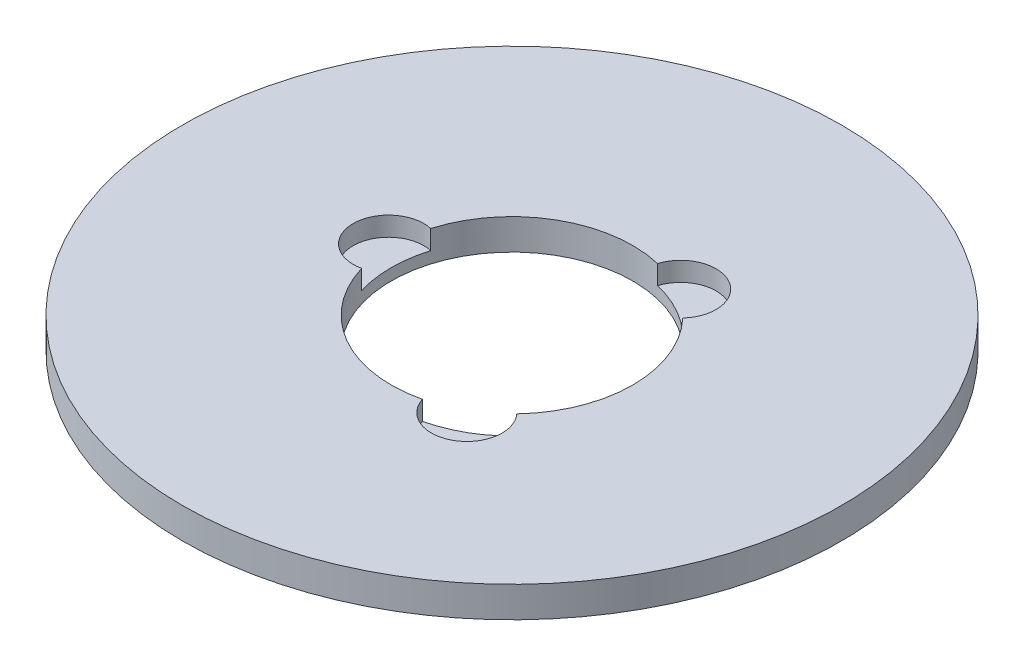
ISO-10303-21;
HEADER;
FILE_DESCRIPTION(('STEP AP214'),'2;1');
FILE_NAME('part.step','',(''),(''),'','','');
FILE_SCHEMA(('AUTOMOTIVE_DESIGN { 1 0 10303 214 1 1 1 1 }'));
ENDSEC;
DATA;
#1=APPLICATION_CONTEXT('core data for automotive mechanical design processes');
#2=APPLICATION_PROTOCOL_DEFINITION('international standard','automotive_design',2000,#1);
#3=PRODUCT_CONTEXT('',#1,'mechanical');
#4=PRODUCT('Part','Part','',(#3));
#5=PRODUCT_RELATED_PRODUCT_CATEGORY('part','',(#4));
#6=PRODUCT_DEFINITION_FORMATION('','',#4);
#7=PRODUCT_DEFINITION_CONTEXT('part definition',#1,'design');
#8=PRODUCT_DEFINITION('design','',#6,#7);
#9=PRODUCT_DEFINITION_SHAPE('','',#8);
#10=(LENGTH_UNIT() NAMED_UNIT(*) SI_UNIT(.MILLI.,.METRE.));
#11=(NAMED_UNIT(*) PLANE_ANGLE_UNIT() SI_UNIT($,.RADIAN.));
#12=(NAMED_UNIT(*) SI_UNIT($,.STERADIAN.) SOLID_ANGLE_UNIT());
#13=UNCERTAINTY_MEASURE_WITH_UNIT(LENGTH_MEASURE(1.E-05),#10,'distance_accuracy_value','');
#14=(GEOMETRIC_REPRESENTATION_CONTEXT(3) GLOBAL_UNCERTAINTY_ASSIGNED_CONTEXT((#13)) GLOBAL_UNIT_ASSIGNED_CONTEXT((#10,
#11,#12)) REPRESENTATION_CONTEXT('',''));
#15=CARTESIAN_POINT('',(0.,0.,0.));
#16=DIRECTION('',(0.,0.,1.));
#17=DIRECTION('',(1.,0.,0.));
#18=AXIS2_PLACEMENT_3D('',#15,#16,#17);
#19=CARTESIAN_POINT('',(0.,7.,0.));
#20=DIRECTION('',(0.,-1.,0.));
#21=DIRECTION('',(0.,0.,-1.));
#22=AXIS2_PLACEMENT_3D('',#19,#20,#21);
#23=CYLINDRICAL_SURFACE('',#22,75.);
#24=CARTESIAN_POINT('',(0.,7.,0.));
#25=DIRECTION('',(0.,1.,0.));
#26=DIRECTION('',(0.,0.,1.));
#27=AXIS2_PLACEMENT_3D('',#24,#25,#26);
#28=CIRCLE('',#27,75.);
#29=CARTESIAN_POINT('',(0.,7.,75.));
#30=VERTEX_POINT('',#29);
#31=EDGE_CURVE('E126',#30,#30,#28,.T.);
#32=ORIENTED_EDGE('',*,*,#31,.F.);
#33=EDGE_LOOP('',(#32));
#34=FACE_BOUND('',#33,.T.);
#35=CARTESIAN_POINT('',(0.,0.,0.));
#36=DIRECTION('',(0.,1.,0.));
#37=DIRECTION('',(0.,0.,1.));
#38=AXIS2_PLACEMENT_3D('',#35,#36,#37);
#39=CIRCLE('',#38,75.);
#40=CARTESIAN_POINT('',(0.,0.,75.));
#41=VERTEX_POINT('',#40);
#42=EDGE_CURVE('E124',#41,#41,#39,.T.);
#43=ORIENTED_EDGE('',*,*,#42,.T.);
#44=EDGE_LOOP('',(#43));
#45=FACE_BOUND('',#44,.T.);
#46=ADVANCED_FACE('F39',(#34,#45),#23,.T.);
#47=CARTESIAN_POINT('',(0.,7.,0.));
#48=DIRECTION('',(0.,1.,0.));
#49=DIRECTION('',(0.,0.,1.));
#50=AXIS2_PLACEMENT_3D('',#47,#48,#49);
#51=PLANE('',#50);
#52=CARTESIAN_POINT('',(14.0511210299688,7.,24.3372555272052));
#53=DIRECTION('',(0.,1.,0.));
#54=DIRECTION('',(0.866025403784436,0.,-0.500000000000004));
#55=AXIS2_PLACEMENT_3D('',#52,#53,#54);
#56=CIRCLE('',#55,8.05009348348537);
#57=CARTESIAN_POINT('',(6.37163110588261,7.,26.7516787706968));
#58=VERTEX_POINT('',#57);
#59=CARTESIAN_POINT('',(19.9818178563632,7.,18.8938337865857));
#60=VERTEX_POINT('',#59);
#61=EDGE_CURVE('E147',#58,#60,#56,.T.);
#62=ORIENTED_EDGE('',*,*,#61,.F.);
#63=CARTESIAN_POINT('',(0.,7.,0.));
#64=DIRECTION('',(0.,1.,0.));
#65=DIRECTION('',(0.,0.,1.));
#66=AXIS2_PLACEMENT_3D('',#63,#64,#65);
#67=CIRCLE('',#66,27.5);
#68=CARTESIAN_POINT('',(-26.3534489622455,7.,7.85784498411104));
#69=VERTEX_POINT('',#68);
#70=EDGE_CURVE('E118',#69,#58,#67,.T.);
#71=ORIENTED_EDGE('',*,*,#70,.F.);
#72=CARTESIAN_POINT('',(-28.1022420599374,7.,0.));
#73=DIRECTION('',(0.,1.,0.));
#74=DIRECTION('',(0.,0.,1.));
#75=AXIS2_PLACEMENT_3D('',#72,#73,#74);
#76=CIRCLE('',#75,8.05009348348537);
#77=CARTESIAN_POINT('',(-26.3534489622455,7.,-7.85784498411104));
#78=VERTEX_POINT('',#77);
#79=EDGE_CURVE('E113',#78,#69,#76,.T.);
#80=ORIENTED_EDGE('',*,*,#79,.F.);
#81=CARTESIAN_POINT('',(6.37163110588224,7.,-26.7516787706969));
#82=VERTEX_POINT('',#81);
#83=EDGE_CURVE('E106',#82,#78,#67,.T.);
#84=ORIENTED_EDGE('',*,*,#83,.F.);
#85=CARTESIAN_POINT('',(14.0511210299685,7.,-24.3372555272054));
#86=DIRECTION('',(0.,1.,0.));
#87=DIRECTION('',(-0.866025403784443,0.,-0.499999999999992));
#88=AXIS2_PLACEMENT_3D('',#85,#86,#87);
#89=CIRCLE('',#88,8.05009348348537);
#90=CARTESIAN_POINT('',(19.9818178563629,7.,-18.893833786586));
#91=VERTEX_POINT('',#90);
#92=EDGE_CURVE('E90',#91,#82,#89,.T.);
#93=ORIENTED_EDGE('',*,*,#92,.F.);
#94=EDGE_CURVE('E116',#60,#91,#67,.T.);
#95=ORIENTED_EDGE('',*,*,#94,.F.);
#96=EDGE_LOOP('',(#62,#71,#80,#84,#93,#95));
#97=FACE_BOUND('',#96,.T.);
#98=ORIENTED_EDGE('',*,*,#31,.T.);
#99=EDGE_LOOP('',(#98));
#100=FACE_BOUND('',#99,.T.);
#101=ADVANCED_FACE('F115',(#97,#100),#51,.T.);
#102=CARTESIAN_POINT('',(0.,0.,0.));
#103=DIRECTION('',(0.,1.,0.));
#104=DIRECTION('',(0.,0.,1.));
#105=AXIS2_PLACEMENT_3D('',#102,#103,#104);
#106=PLANE('',#105);
#107=CARTESIAN_POINT('',(0.,0.,0.));
#108=DIRECTION('',(0.,1.,0.));
#109=DIRECTION('',(0.,0.,1.));
#110=AXIS2_PLACEMENT_3D('',#107,#108,#109);
#111=CIRCLE('',#110,27.5);
#112=CARTESIAN_POINT('',(0.,0.,27.5));
#113=VERTEX_POINT('',#112);
#114=EDGE_CURVE('E120',#113,#113,#111,.T.);
#115=ORIENTED_EDGE('',*,*,#114,.T.);
#116=EDGE_LOOP('',(#115));
#117=FACE_BOUND('',#116,.T.);
#118=ORIENTED_EDGE('',*,*,#42,.F.);
#119=EDGE_LOOP('',(#118));
#120=FACE_BOUND('',#119,.T.);
#121=ADVANCED_FACE('F164',(#117,#120),#106,.F.);
#122=CARTESIAN_POINT('',(0.,7.,0.));
#123=DIRECTION('',(0.,-1.,0.));
#124=DIRECTION('',(0.,0.,-1.));
#125=AXIS2_PLACEMENT_3D('',#122,#123,#124);
#126=CYLINDRICAL_SURFACE('',#125,27.5);
#127=DIRECTION('',(0.,1.,0.));
#128=VECTOR('',#127,1.);
#129=CARTESIAN_POINT('',(6.37163110588261,4.81713700644268,26.7516787706968));
#130=LINE('',#129,#128);
#131=CARTESIAN_POINT('',(6.37163110588261,2.63427401288536,26.7516787706968));
#132=VERTEX_POINT('',#131);
#133=EDGE_CURVE('E11',#132,#58,#130,.T.);
#134=ORIENTED_EDGE('',*,*,#133,.F.);
#135=CARTESIAN_POINT('',(0.,2.63427401288536,0.));
#136=DIRECTION('',(0.,1.,0.));
#137=DIRECTION('',(0.,0.,1.));
#138=AXIS2_PLACEMENT_3D('',#135,#136,#137);
#139=CIRCLE('',#138,27.5);
#140=CARTESIAN_POINT('',(19.9818178563632,2.63427401288536,18.8938337865857));
#141=VERTEX_POINT('',#140);
#142=EDGE_CURVE('E144',#132,#141,#139,.T.);
#143=ORIENTED_EDGE('',*,*,#142,.T.);
#144=DIRECTION('',(0.,1.,0.));
#145=VECTOR('',#144,1.);
#146=CARTESIAN_POINT('',(19.9818178563632,4.81713700644268,18.8938337865857));
#147=LINE('',#146,#145);
#148=EDGE_CURVE('E46',#60,#141,#147,.F.);
#149=ORIENTED_EDGE('',*,*,#148,.F.);
#150=ORIENTED_EDGE('',*,*,#94,.T.);
#151=DIRECTION('',(0.,1.,0.));
#152=VECTOR('',#151,1.);
#153=CARTESIAN_POINT('',(19.9818178563629,4.81713700644268,-18.893833786586));
#154=LINE('',#153,#152);
#155=CARTESIAN_POINT('',(19.9818178563629,2.63427401288536,-18.893833786586));
#156=VERTEX_POINT('',#155);
#157=EDGE_CURVE('E92',#156,#91,#154,.T.);
#158=ORIENTED_EDGE('',*,*,#157,.F.);
#159=CARTESIAN_POINT('',(0.,2.63427401288536,0.));
#160=DIRECTION('',(0.,1.,0.));
#161=DIRECTION('',(0.,0.,1.));
#162=AXIS2_PLACEMENT_3D('',#159,#160,#161);
#163=CIRCLE('',#162,27.5);
#164=CARTESIAN_POINT('',(6.37163110588224,2.63427401288536,-26.7516787706969));
#165=VERTEX_POINT('',#164);
#166=EDGE_CURVE('E107',#156,#165,#163,.T.);
#167=ORIENTED_EDGE('',*,*,#166,.T.);
#168=DIRECTION('',(0.,1.,0.));
#169=VECTOR('',#168,1.);
#170=CARTESIAN_POINT('',(6.37163110588224,4.81713700644268,-26.7516787706969));
#171=LINE('',#170,#169);
#172=EDGE_CURVE('E95',#82,#165,#171,.F.);
#173=ORIENTED_EDGE('',*,*,#172,.F.);
#174=ORIENTED_EDGE('',*,*,#83,.T.);
#175=DIRECTION('',(0.,1.,0.));
#176=VECTOR('',#175,1.);
#177=CARTESIAN_POINT('',(-26.3534489622456,4.81713700644268,-7.85784498411104));
#178=LINE('',#177,#176);
#179=CARTESIAN_POINT('',(-26.3534489622455,2.63427401288536,-7.85784498411104));
#180=VERTEX_POINT('',#179);
#181=EDGE_CURVE('E143',#180,#78,#178,.T.);
#182=ORIENTED_EDGE('',*,*,#181,.F.);
#183=CARTESIAN_POINT('',(0.,2.63427401288536,0.));
#184=DIRECTION('',(0.,1.,0.));
#185=DIRECTION('',(0.,0.,1.));
#186=AXIS2_PLACEMENT_3D('',#183,#184,#185);
#187=CIRCLE('',#186,27.5);
#188=CARTESIAN_POINT('',(-26.3534489622455,2.63427401288536,7.85784498411104));
#189=VERTEX_POINT('',#188);
#190=EDGE_CURVE('E132',#180,#189,#187,.T.);
#191=ORIENTED_EDGE('',*,*,#190,.T.);
#192=DIRECTION('',(0.,1.,0.));
#193=VECTOR('',#192,1.);
#194=CARTESIAN_POINT('',(-26.3534489622456,4.81713700644268,7.85784498411104));
#195=LINE('',#194,#193);
#196=EDGE_CURVE('E137',#69,#189,#195,.F.);
#197=ORIENTED_EDGE('',*,*,#196,.F.);
#198=ORIENTED_EDGE('',*,*,#70,.T.);
#199=EDGE_LOOP('',(#134,#143,#149,#150,#158,#167,#173,#174,#182,#191,#197,#198));
#200=FACE_BOUND('',#199,.T.);
#201=ORIENTED_EDGE('',*,*,#114,.F.);
#202=EDGE_LOOP('',(#201));
#203=FACE_BOUND('',#202,.T.);
#204=ADVANCED_FACE('F103',(#200,#203),#126,.F.);
#205=CARTESIAN_POINT('',(-28.1022420599374,2.63427401288536,0.));
#206=DIRECTION('',(0.,1.,0.));
#207=DIRECTION('',(0.,0.,1.));
#208=AXIS2_PLACEMENT_3D('',#205,#206,#207);
#209=CYLINDRICAL_SURFACE('',#208,8.05009348348537);
#210=ORIENTED_EDGE('',*,*,#181,.T.);
#211=ORIENTED_EDGE('',*,*,#79,.T.);
#212=ORIENTED_EDGE('',*,*,#196,.T.);
#213=CARTESIAN_POINT('',(-28.1022420599374,2.63427401288536,0.));
#214=DIRECTION('',(0.,1.,0.));
#215=DIRECTION('',(0.,0.,1.));
#216=AXIS2_PLACEMENT_3D('',#213,#214,#215);
#217=CIRCLE('',#216,8.05009348348537);
#218=EDGE_CURVE('E121',#180,#189,#217,.T.);
#219=ORIENTED_EDGE('',*,*,#218,.F.);
#220=EDGE_LOOP('',(#210,#211,#212,#219));
#221=FACE_BOUND('',#220,.T.);
#222=ADVANCED_FACE('F174',(#221),#209,.F.);
#223=CARTESIAN_POINT('',(-28.1022420599374,2.63427401288536,0.));
#224=DIRECTION('',(0.,1.,0.));
#225=DIRECTION('',(0.,0.,1.));
#226=AXIS2_PLACEMENT_3D('',#223,#224,#225);
#227=PLANE('',#226);
#228=ORIENTED_EDGE('',*,*,#218,.T.);
#229=ORIENTED_EDGE('',*,*,#190,.F.);
#230=EDGE_LOOP('',(#228,#229));
#231=FACE_BOUND('',#230,.T.);
#232=ADVANCED_FACE('F177',(#231),#227,.T.);
#233=CARTESIAN_POINT('',(14.0511210299685,2.63427401288536,-24.3372555272054));
#234=DIRECTION('',(0.,1.,0.));
#235=DIRECTION('',(0.,0.,1.));
#236=AXIS2_PLACEMENT_3D('',#233,#234,#235);
#237=CYLINDRICAL_SURFACE('',#236,8.05009348348537);
#238=ORIENTED_EDGE('',*,*,#157,.T.);
#239=ORIENTED_EDGE('',*,*,#92,.T.);
#240=ORIENTED_EDGE('',*,*,#172,.T.);
#241=CARTESIAN_POINT('',(14.0511210299685,2.63427401288536,-24.3372555272054));
#242=DIRECTION('',(0.,1.,0.));
#243=DIRECTION('',(-0.866025403784443,0.,-0.499999999999992));
#244=AXIS2_PLACEMENT_3D('',#241,#242,#243);
#245=CIRCLE('',#244,8.05009348348537);
#246=EDGE_CURVE('E56',#156,#165,#245,.T.);
#247=ORIENTED_EDGE('',*,*,#246,.F.);
#248=EDGE_LOOP('',(#238,#239,#240,#247));
#249=FACE_BOUND('',#248,.T.);
#250=ADVANCED_FACE('F93',(#249),#237,.F.);
#251=CARTESIAN_POINT('',(14.0511210299685,2.63427401288536,-24.3372555272054));
#252=DIRECTION('',(0.,1.,0.));
#253=DIRECTION('',(-0.866025403784443,0.,-0.499999999999992));
#254=AXIS2_PLACEMENT_3D('',#251,#252,#253);
#255=PLANE('',#254);
#256=ORIENTED_EDGE('',*,*,#246,.T.);
#257=ORIENTED_EDGE('',*,*,#166,.F.);
#258=EDGE_LOOP('',(#256,#257));
#259=FACE_BOUND('',#258,.T.);
#260=ADVANCED_FACE('F160',(#259),#255,.T.);
#261=CARTESIAN_POINT('',(14.0511210299688,2.63427401288536,24.3372555272052));
#262=DIRECTION('',(0.,1.,0.));
#263=DIRECTION('',(0.,0.,1.));
#264=AXIS2_PLACEMENT_3D('',#261,#262,#263);
#265=CYLINDRICAL_SURFACE('',#264,8.05009348348537);
#266=ORIENTED_EDGE('',*,*,#133,.T.);
#267=ORIENTED_EDGE('',*,*,#61,.T.);
#268=ORIENTED_EDGE('',*,*,#148,.T.);
#269=CARTESIAN_POINT('',(14.0511210299688,2.63427401288536,24.3372555272052));
#270=DIRECTION('',(0.,1.,0.));
#271=DIRECTION('',(0.866025403784436,0.,-0.500000000000004));
#272=AXIS2_PLACEMENT_3D('',#269,#270,#271);
#273=CIRCLE('',#272,8.05009348348537);
#274=EDGE_CURVE('E55',#132,#141,#273,.T.);
#275=ORIENTED_EDGE('',*,*,#274,.F.);
#276=EDGE_LOOP('',(#266,#267,#268,#275));
#277=FACE_BOUND('',#276,.T.);
#278=ADVANCED_FACE('F149',(#277),#265,.F.);
#279=CARTESIAN_POINT('',(14.0511210299688,2.63427401288536,24.3372555272052));
#280=DIRECTION('',(0.,1.,0.));
#281=DIRECTION('',(0.866025403784436,0.,-0.500000000000004));
#282=AXIS2_PLACEMENT_3D('',#279,#280,#281);
#283=PLANE('',#282);
#284=ORIENTED_EDGE('',*,*,#274,.T.);
#285=ORIENTED_EDGE('',*,*,#142,.F.);
#286=EDGE_LOOP('',(#284,#285));
#287=FACE_BOUND('',#286,.T.);
#288=ADVANCED_FACE('F151',(#287),#283,.T.);
#289=CLOSED_SHELL('',(#46,#101,#121,#204,#222,#232,#250,#260,#278,#288));
#290=MANIFOLD_SOLID_BREP('B2',#289);
#291=ADVANCED_BREP_SHAPE_REPRESENTATION('',(#18,#290),#14);
#292=SHAPE_DEFINITION_REPRESENTATION(#9,#291);
ENDSEC;
END-ISO-10303-21;
